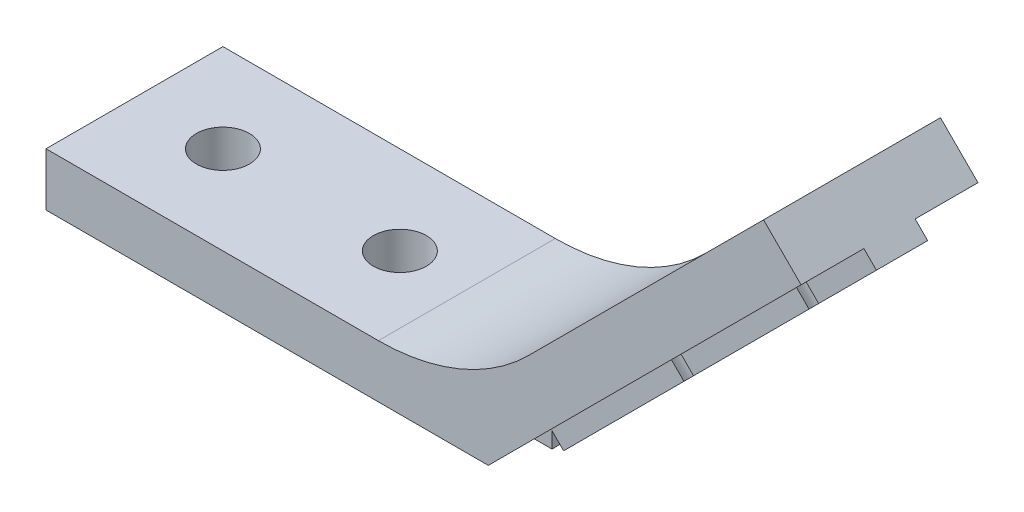
ISO-10303-21;
HEADER;
FILE_DESCRIPTION(('STEP AP214'),'2;1');
FILE_NAME('part.step','',(''),(''),'','','');
FILE_SCHEMA(('AUTOMOTIVE_DESIGN { 1 0 10303 214 1 1 1 1 }'));
ENDSEC;
DATA;
#1=APPLICATION_CONTEXT('core data for automotive mechanical design processes');
#2=APPLICATION_PROTOCOL_DEFINITION('international standard','automotive_design',2000,#1);
#3=PRODUCT_CONTEXT('',#1,'mechanical');
#4=PRODUCT('Part','Part','',(#3));
#5=PRODUCT_RELATED_PRODUCT_CATEGORY('part','',(#4));
#6=PRODUCT_DEFINITION_FORMATION('','',#4);
#7=PRODUCT_DEFINITION_CONTEXT('part definition',#1,'design');
#8=PRODUCT_DEFINITION('design','',#6,#7);
#9=PRODUCT_DEFINITION_SHAPE('','',#8);
#10=(LENGTH_UNIT() NAMED_UNIT(*) SI_UNIT(.MILLI.,.METRE.));
#11=(NAMED_UNIT(*) PLANE_ANGLE_UNIT() SI_UNIT($,.RADIAN.));
#12=(NAMED_UNIT(*) SI_UNIT($,.STERADIAN.) SOLID_ANGLE_UNIT());
#13=UNCERTAINTY_MEASURE_WITH_UNIT(LENGTH_MEASURE(1.E-05),#10,'distance_accuracy_value','');
#14=(GEOMETRIC_REPRESENTATION_CONTEXT(3) GLOBAL_UNCERTAINTY_ASSIGNED_CONTEXT((#13)) GLOBAL_UNIT_ASSIGNED_CONTEXT((#10,
#11,#12)) REPRESENTATION_CONTEXT('',''));
#15=CARTESIAN_POINT('',(0.,0.,0.));
#16=DIRECTION('',(0.,0.,1.));
#17=DIRECTION('',(1.,0.,0.));
#18=AXIS2_PLACEMENT_3D('',#15,#16,#17);
#19=CARTESIAN_POINT('',(18.3847763108502,16.9705627484772,6.45));
#20=DIRECTION('',(0.,0.,-1.));
#21=DIRECTION('',(0.,1.,0.));
#22=AXIS2_PLACEMENT_3D('',#19,#20,#21);
#23=PLANE('',#22);
#24=DIRECTION('',(-0.707106781186547,-0.707106781186548,0.));
#25=VECTOR('',#24,1.);
#26=CARTESIAN_POINT('',(17.6776695296637,17.6776695296637,6.45));
#27=LINE('',#26,#25);
#28=CARTESIAN_POINT('',(17.6776695296637,17.6776695296637,6.45));
#29=VERTEX_POINT('',#28);
#30=CARTESIAN_POINT('',(14.4137051360109,14.413705136011,6.45));
#31=VERTEX_POINT('',#30);
#32=EDGE_CURVE('E248',#29,#31,#27,.T.);
#33=ORIENTED_EDGE('',*,*,#32,.T.);
#34=DIRECTION('',(0.707106781186548,-0.707106781186547,0.));
#35=VECTOR('',#34,1.);
#36=CARTESIAN_POINT('',(-7.98578980060077,36.8132000726226,6.45));
#37=LINE('',#36,#35);
#38=CARTESIAN_POINT('',(15.1208119171975,13.7065983548244,6.45));
#39=VERTEX_POINT('',#38);
#40=EDGE_CURVE('E237',#31,#39,#37,.T.);
#41=ORIENTED_EDGE('',*,*,#40,.T.);
#42=DIRECTION('',(-0.707106781186547,-0.707106781186548,0.));
#43=VECTOR('',#42,1.);
#44=CARTESIAN_POINT('',(18.3847763108502,16.9705627484772,6.45));
#45=LINE('',#44,#43);
#46=CARTESIAN_POINT('',(18.3847763108502,16.9705627484772,6.45));
#47=VERTEX_POINT('',#46);
#48=EDGE_CURVE('E246',#47,#39,#45,.T.);
#49=ORIENTED_EDGE('',*,*,#48,.F.);
#50=DIRECTION('',(-0.707106781186548,0.707106781186547,0.));
#51=VECTOR('',#50,1.);
#52=CARTESIAN_POINT('',(18.3847763108502,16.9705627484772,6.45));
#53=LINE('',#52,#51);
#54=EDGE_CURVE('E293',#47,#29,#53,.T.);
#55=ORIENTED_EDGE('',*,*,#54,.T.);
#56=EDGE_LOOP('',(#33,#41,#49,#55));
#57=FACE_BOUND('',#56,.T.);
#58=ADVANCED_FACE('F34',(#57),#23,.F.);
#59=CARTESIAN_POINT('',(18.3847763108502,16.9705627484772,3.55));
#60=DIRECTION('',(0.,0.,1.));
#61=DIRECTION('',(0.,-1.,0.));
#62=AXIS2_PLACEMENT_3D('',#59,#60,#61);
#63=PLANE('',#62);
#64=DIRECTION('',(0.707106781186547,0.707106781186548,0.));
#65=VECTOR('',#64,1.);
#66=CARTESIAN_POINT('',(17.6776695296637,17.6776695296637,3.55));
#67=LINE('',#66,#65);
#68=CARTESIAN_POINT('',(7.34263732414546,7.34263732414548,3.55));
#69=VERTEX_POINT('',#68);
#70=CARTESIAN_POINT('',(13.8705661114509,13.870566111451,3.55));
#71=VERTEX_POINT('',#70);
#72=EDGE_CURVE('E269',#69,#71,#67,.T.);
#73=ORIENTED_EDGE('',*,*,#72,.T.);
#74=DIRECTION('',(0.707106781186548,-0.707106781186547,0.));
#75=VECTOR('',#74,1.);
#76=CARTESIAN_POINT('',(-8.52892882516078,36.2700610480626,3.55));
#77=LINE('',#76,#75);
#78=CARTESIAN_POINT('',(14.5776728926375,13.1634593302644,3.55));
#79=VERTEX_POINT('',#78);
#80=EDGE_CURVE('E249',#71,#79,#77,.T.);
#81=ORIENTED_EDGE('',*,*,#80,.T.);
#82=DIRECTION('',(0.707106781186547,0.707106781186548,0.));
#83=VECTOR('',#82,1.);
#84=CARTESIAN_POINT('',(18.3847763108502,16.9705627484772,3.55));
#85=LINE('',#84,#83);
#86=CARTESIAN_POINT('',(8.04974410533202,6.63553054295894,3.55));
#87=VERTEX_POINT('',#86);
#88=EDGE_CURVE('E296',#87,#79,#85,.T.);
#89=ORIENTED_EDGE('',*,*,#88,.F.);
#90=DIRECTION('',(0.707106781186548,-0.707106781186547,0.));
#91=VECTOR('',#90,1.);
#92=CARTESIAN_POINT('',(-15.0568576124662,29.7421322607571,3.55));
#93=LINE('',#92,#91);
#94=EDGE_CURVE('E57',#87,#69,#93,.F.);
#95=ORIENTED_EDGE('',*,*,#94,.T.);
#96=EDGE_LOOP('',(#73,#81,#89,#95));
#97=FACE_BOUND('',#96,.T.);
#98=ADVANCED_FACE('F549',(#97),#63,.F.);
#99=CARTESIAN_POINT('',(0.707106781186548,-0.707106781186547,0.));
#100=DIRECTION('',(0.707106781186548,-0.707106781186547,0.));
#101=DIRECTION('',(0.707106781186547,0.707106781186548,0.));
#102=AXIS2_PLACEMENT_3D('',#99,#100,#101);
#103=PLANE('',#102);
#104=CARTESIAN_POINT('',(14.8492424049175,13.4350288425444,5.));
#105=DIRECTION('',(0.707106781186548,-0.707106781186547,0.));
#106=DIRECTION('',(0.707106781186547,0.707106781186548,0.));
#107=AXIS2_PLACEMENT_3D('',#104,#105,#106);
#108=CIRCLE('',#107,1.5);
#109=CARTESIAN_POINT('',(14.5776728926375,13.1634593302644,6.45));
#110=VERTEX_POINT('',#109);
#111=EDGE_CURVE('E11',#110,#79,#108,.T.);
#112=ORIENTED_EDGE('',*,*,#111,.F.);
#113=CARTESIAN_POINT('',(8.04974410533203,6.63553054295895,6.45));
#114=VERTEX_POINT('',#113);
#115=EDGE_CURVE('E257',#110,#114,#45,.T.);
#116=ORIENTED_EDGE('',*,*,#115,.T.);
#117=CARTESIAN_POINT('',(7.77817459305202,6.36396103067894,5.));
#118=DIRECTION('',(0.707106781186548,-0.707106781186547,0.));
#119=DIRECTION('',(0.707106781186547,0.707106781186548,0.));
#120=AXIS2_PLACEMENT_3D('',#117,#118,#119);
#121=CIRCLE('',#120,1.5);
#122=EDGE_CURVE('E459',#87,#114,#121,.T.);
#123=ORIENTED_EDGE('',*,*,#122,.F.);
#124=ORIENTED_EDGE('',*,*,#88,.T.);
#125=EDGE_LOOP('',(#112,#116,#123,#124));
#126=FACE_BOUND('',#125,.T.);
#127=ADVANCED_FACE('F552',(#126),#103,.T.);
#128=ORIENTED_EDGE('',*,*,#115,.F.);
#129=DIRECTION('',(0.707106781186548,-0.707106781186547,0.));
#130=VECTOR('',#129,1.);
#131=CARTESIAN_POINT('',(-8.52892882516078,36.2700610480626,6.45));
#132=LINE('',#131,#130);
#133=CARTESIAN_POINT('',(13.8705661114509,13.870566111451,6.45));
#134=VERTEX_POINT('',#133);
#135=EDGE_CURVE('E489',#110,#134,#132,.F.);
#136=ORIENTED_EDGE('',*,*,#135,.T.);
#137=CARTESIAN_POINT('',(7.34263732414548,7.3426373241455,6.45));
#138=VERTEX_POINT('',#137);
#139=EDGE_CURVE('E288',#134,#138,#27,.T.);
#140=ORIENTED_EDGE('',*,*,#139,.T.);
#141=DIRECTION('',(0.707106781186548,-0.707106781186547,0.));
#142=VECTOR('',#141,1.);
#143=CARTESIAN_POINT('',(-15.0568576124662,29.7421322607571,6.45));
#144=LINE('',#143,#142);
#145=EDGE_CURVE('E488',#138,#114,#144,.T.);
#146=ORIENTED_EDGE('',*,*,#145,.T.);
#147=EDGE_LOOP('',(#128,#136,#140,#146));
#148=FACE_BOUND('',#147,.T.);
#149=ADVANCED_FACE('F487',(#148),#23,.F.);
#150=CARTESIAN_POINT('',(0.,0.,3.54999999999999));
#151=VERTEX_POINT('',#150);
#152=CARTESIAN_POINT('',(6.79949829958547,6.79949829958549,3.55));
#153=VERTEX_POINT('',#152);
#154=EDGE_CURVE('E263',#151,#153,#67,.T.);
#155=ORIENTED_EDGE('',*,*,#154,.T.);
#156=DIRECTION('',(0.707106781186548,-0.707106781186547,0.));
#157=VECTOR('',#156,1.);
#158=CARTESIAN_POINT('',(-15.5999966370262,29.1989932361971,3.55));
#159=LINE('',#158,#157);
#160=CARTESIAN_POINT('',(7.50660508077202,6.09239151839894,3.55));
#161=VERTEX_POINT('',#160);
#162=EDGE_CURVE('E464',#153,#161,#159,.T.);
#163=ORIENTED_EDGE('',*,*,#162,.T.);
#164=CARTESIAN_POINT('',(0.707106781186549,-0.707106781186546,3.54999999999999));
#165=VERTEX_POINT('',#164);
#166=EDGE_CURVE('E294',#165,#161,#85,.T.);
#167=ORIENTED_EDGE('',*,*,#166,.F.);
#168=DIRECTION('',(-0.707106781186548,0.707106781186547,0.));
#169=VECTOR('',#168,1.);
#170=CARTESIAN_POINT('',(0.707106781186549,-0.707106781186546,3.54999999999999));
#171=LINE('',#170,#169);
#172=EDGE_CURVE('E303',#165,#151,#171,.T.);
#173=ORIENTED_EDGE('',*,*,#172,.T.);
#174=EDGE_LOOP('',(#155,#163,#167,#173));
#175=FACE_BOUND('',#174,.T.);
#176=ADVANCED_FACE('F468',(#175),#63,.F.);
#177=CARTESIAN_POINT('',(7.506605080772,6.09239151839893,6.45));
#178=VERTEX_POINT('',#177);
#179=EDGE_CURVE('E242',#178,#161,#121,.T.);
#180=ORIENTED_EDGE('',*,*,#179,.F.);
#181=CARTESIAN_POINT('',(0.707106781186548,-0.707106781186547,6.45));
#182=VERTEX_POINT('',#181);
#183=EDGE_CURVE('E259',#178,#182,#45,.T.);
#184=ORIENTED_EDGE('',*,*,#183,.T.);
#185=DIRECTION('',(0.,0.,-1.));
#186=VECTOR('',#185,1.);
#187=CARTESIAN_POINT('',(0.707106781186548,-0.707106781186547,6.45));
#188=LINE('',#187,#186);
#189=EDGE_CURVE('E256',#182,#165,#188,.T.);
#190=ORIENTED_EDGE('',*,*,#189,.T.);
#191=ORIENTED_EDGE('',*,*,#166,.T.);
#192=EDGE_LOOP('',(#180,#184,#190,#191));
#193=FACE_BOUND('',#192,.T.);
#194=ADVANCED_FACE('F557',(#193),#103,.T.);
#195=CARTESIAN_POINT('',(0.,0.,10.));
#196=DIRECTION('',(-0.707106781186548,0.707106781186547,0.));
#197=DIRECTION('',(-0.707106781186547,-0.707106781186548,0.));
#198=AXIS2_PLACEMENT_3D('',#195,#196,#197);
#199=PLANE('',#198);
#200=ORIENTED_EDGE('',*,*,#139,.F.);
#201=CARTESIAN_POINT('',(14.1421356237309,14.142135623731,5.));
#202=DIRECTION('',(-0.707106781186548,0.707106781186547,0.));
#203=DIRECTION('',(-0.707106781186547,-0.707106781186548,0.));
#204=AXIS2_PLACEMENT_3D('',#201,#202,#203);
#205=CIRCLE('',#204,1.5);
#206=EDGE_CURVE('E536',#134,#31,#205,.T.);
#207=ORIENTED_EDGE('',*,*,#206,.T.);
#208=ORIENTED_EDGE('',*,*,#32,.F.);
#209=DIRECTION('',(0.,0.,-1.));
#210=VECTOR('',#209,1.);
#211=CARTESIAN_POINT('',(17.6776695296637,17.6776695296637,10.));
#212=LINE('',#211,#210);
#213=CARTESIAN_POINT('',(17.6776695296637,17.6776695296637,10.));
#214=VERTEX_POINT('',#213);
#215=EDGE_CURVE('E309',#214,#29,#212,.T.);
#216=ORIENTED_EDGE('',*,*,#215,.F.);
#217=DIRECTION('',(0.707106781186547,0.707106781186548,0.));
#218=VECTOR('',#217,1.);
#219=CARTESIAN_POINT('',(0.,0.,10.));
#220=LINE('',#219,#218);
#221=CARTESIAN_POINT('',(0.,0.,10.));
#222=VERTEX_POINT('',#221);
#223=EDGE_CURVE('E403',#222,#214,#220,.T.);
#224=ORIENTED_EDGE('',*,*,#223,.F.);
#225=DIRECTION('',(0.,0.,-1.));
#226=VECTOR('',#225,1.);
#227=CARTESIAN_POINT('',(0.,0.,10.));
#228=LINE('',#227,#226);
#229=CARTESIAN_POINT('',(0.,0.,6.45));
#230=VERTEX_POINT('',#229);
#231=EDGE_CURVE('E443',#222,#230,#228,.T.);
#232=ORIENTED_EDGE('',*,*,#231,.T.);
#233=CARTESIAN_POINT('',(6.79949829958546,6.79949829958547,6.45));
#234=VERTEX_POINT('',#233);
#235=EDGE_CURVE('E290',#234,#230,#27,.T.);
#236=ORIENTED_EDGE('',*,*,#235,.F.);
#237=CARTESIAN_POINT('',(7.07106781186547,7.07106781186549,5.));
#238=DIRECTION('',(-0.707106781186548,0.707106781186547,0.));
#239=DIRECTION('',(-0.707106781186547,-0.707106781186548,0.));
#240=AXIS2_PLACEMENT_3D('',#237,#238,#239);
#241=CIRCLE('',#240,1.5);
#242=EDGE_CURVE('E469',#234,#138,#241,.T.);
#243=ORIENTED_EDGE('',*,*,#242,.T.);
#244=EDGE_LOOP('',(#200,#207,#208,#216,#224,#232,#236,#243));
#245=FACE_BOUND('',#244,.T.);
#246=ADVANCED_FACE('F492',(#245),#199,.F.);
#247=CARTESIAN_POINT('',(14.4137051360109,14.413705136011,3.55));
#248=VERTEX_POINT('',#247);
#249=CARTESIAN_POINT('',(17.6776695296637,17.6776695296637,3.55));
#250=VERTEX_POINT('',#249);
#251=EDGE_CURVE('E271',#248,#250,#67,.T.);
#252=ORIENTED_EDGE('',*,*,#251,.F.);
#253=CARTESIAN_POINT('',(14.1421356237309,14.142135623731,5.));
#254=DIRECTION('',(-0.707106781186548,0.707106781186547,0.));
#255=DIRECTION('',(-0.707106781186547,-0.707106781186548,0.));
#256=AXIS2_PLACEMENT_3D('',#253,#254,#255);
#257=CIRCLE('',#256,1.5);
#258=EDGE_CURVE('E250',#248,#71,#257,.T.);
#259=ORIENTED_EDGE('',*,*,#258,.T.);
#260=ORIENTED_EDGE('',*,*,#72,.F.);
#261=CARTESIAN_POINT('',(7.07106781186547,7.07106781186549,5.));
#262=DIRECTION('',(-0.707106781186548,0.707106781186547,0.));
#263=DIRECTION('',(-0.707106781186547,-0.707106781186548,0.));
#264=AXIS2_PLACEMENT_3D('',#261,#262,#263);
#265=CIRCLE('',#264,1.5);
#266=EDGE_CURVE('E474',#69,#153,#265,.T.);
#267=ORIENTED_EDGE('',*,*,#266,.T.);
#268=ORIENTED_EDGE('',*,*,#154,.F.);
#269=CARTESIAN_POINT('',(0.,0.,0.));
#270=VERTEX_POINT('',#269);
#271=EDGE_CURVE('E442',#151,#270,#228,.T.);
#272=ORIENTED_EDGE('',*,*,#271,.T.);
#273=DIRECTION('',(0.707106781186547,0.707106781186548,0.));
#274=VECTOR('',#273,1.);
#275=CARTESIAN_POINT('',(0.,0.,0.));
#276=LINE('',#275,#274);
#277=CARTESIAN_POINT('',(17.6776695296637,17.6776695296637,0.));
#278=VERTEX_POINT('',#277);
#279=EDGE_CURVE('E419',#270,#278,#276,.T.);
#280=ORIENTED_EDGE('',*,*,#279,.T.);
#281=EDGE_CURVE('E440',#250,#278,#212,.T.);
#282=ORIENTED_EDGE('',*,*,#281,.F.);
#283=EDGE_LOOP('',(#252,#259,#260,#267,#268,#272,#280,#282));
#284=FACE_BOUND('',#283,.T.);
#285=ADVANCED_FACE('F517',(#284),#199,.F.);
#286=CARTESIAN_POINT('',(0.,-1.,6.4));
#287=DIRECTION('',(0.,0.,-1.));
#288=DIRECTION('',(-1.,0.,0.));
#289=AXIS2_PLACEMENT_3D('',#286,#287,#288);
#290=PLANE('',#289);
#291=DIRECTION('',(-1.,0.,0.));
#292=VECTOR('',#291,1.);
#293=CARTESIAN_POINT('',(0.,0.,6.4));
#294=LINE('',#293,#292);
#295=CARTESIAN_POINT('',(0.,0.,6.4));
#296=VERTEX_POINT('',#295);
#297=CARTESIAN_POINT('',(-9.46148351928657,0.,6.4));
#298=VERTEX_POINT('',#297);
#299=EDGE_CURVE('E377',#296,#298,#294,.T.);
#300=ORIENTED_EDGE('',*,*,#299,.T.);
#301=DIRECTION('',(0.,-1.,0.));
#302=VECTOR('',#301,1.);
#303=CARTESIAN_POINT('',(-9.46148351928657,19.7989898732234,6.4));
#304=LINE('',#303,#302);
#305=CARTESIAN_POINT('',(-9.46148351928657,-1.,6.4));
#306=VERTEX_POINT('',#305);
#307=EDGE_CURVE('E329',#298,#306,#304,.T.);
#308=ORIENTED_EDGE('',*,*,#307,.T.);
#309=DIRECTION('',(-1.,0.,0.));
#310=VECTOR('',#309,1.);
#311=CARTESIAN_POINT('',(0.,-1.,6.4));
#312=LINE('',#311,#310);
#313=CARTESIAN_POINT('',(0.,-1.,6.4));
#314=VERTEX_POINT('',#313);
#315=EDGE_CURVE('E362',#314,#306,#312,.T.);
#316=ORIENTED_EDGE('',*,*,#315,.F.);
#317=DIRECTION('',(0.,1.,0.));
#318=VECTOR('',#317,1.);
#319=CARTESIAN_POINT('',(0.,-1.,6.4));
#320=LINE('',#319,#318);
#321=EDGE_CURVE('E393',#314,#296,#320,.T.);
#322=ORIENTED_EDGE('',*,*,#321,.T.);
#323=EDGE_LOOP('',(#300,#308,#316,#322));
#324=FACE_BOUND('',#323,.T.);
#325=ADVANCED_FACE('F500',(#324),#290,.F.);
#326=CARTESIAN_POINT('',(0.,-1.,0.));
#327=DIRECTION('',(0.,1.,0.));
#328=DIRECTION('',(0.,0.,1.));
#329=AXIS2_PLACEMENT_3D('',#326,#327,#328);
#330=PLANE('',#329);
#331=ORIENTED_EDGE('',*,*,#315,.T.);
#332=CARTESIAN_POINT('',(-10.,-1.,5.));
#333=DIRECTION('',(0.,-1.,0.));
#334=DIRECTION('',(0.,0.,-1.));
#335=AXIS2_PLACEMENT_3D('',#332,#333,#334);
#336=CIRCLE('',#335,1.5);
#337=CARTESIAN_POINT('',(-9.46148351928655,-1.,3.6));
#338=VERTEX_POINT('',#337);
#339=EDGE_CURVE('E315',#338,#306,#336,.T.);
#340=ORIENTED_EDGE('',*,*,#339,.F.);
#341=DIRECTION('',(1.,0.,0.));
#342=VECTOR('',#341,1.);
#343=CARTESIAN_POINT('',(0.,-1.,3.6));
#344=LINE('',#343,#342);
#345=CARTESIAN_POINT('',(0.,-1.,3.6));
#346=VERTEX_POINT('',#345);
#347=EDGE_CURVE('E368',#338,#346,#344,.T.);
#348=ORIENTED_EDGE('',*,*,#347,.T.);
#349=DIRECTION('',(0.,0.,1.));
#350=VECTOR('',#349,1.);
#351=CARTESIAN_POINT('',(0.,-1.,6.4));
#352=LINE('',#351,#350);
#353=EDGE_CURVE('E357',#346,#314,#352,.T.);
#354=ORIENTED_EDGE('',*,*,#353,.T.);
#355=EDGE_LOOP('',(#331,#340,#348,#354));
#356=FACE_BOUND('',#355,.T.);
#357=ADVANCED_FACE('F593',(#356),#330,.F.);
#358=CARTESIAN_POINT('',(0.,-1.,3.6));
#359=DIRECTION('',(0.,0.,1.));
#360=DIRECTION('',(1.,0.,0.));
#361=AXIS2_PLACEMENT_3D('',#358,#359,#360);
#362=PLANE('',#361);
#363=DIRECTION('',(1.,0.,0.));
#364=VECTOR('',#363,1.);
#365=CARTESIAN_POINT('',(0.,0.,3.6));
#366=LINE('',#365,#364);
#367=CARTESIAN_POINT('',(-19.4614835192866,0.,3.59999999999999));
#368=VERTEX_POINT('',#367);
#369=CARTESIAN_POINT('',(-10.5385164807134,0.,3.6));
#370=VERTEX_POINT('',#369);
#371=EDGE_CURVE('E384',#368,#370,#366,.T.);
#372=ORIENTED_EDGE('',*,*,#371,.T.);
#373=DIRECTION('',(0.,-1.,0.));
#374=VECTOR('',#373,1.);
#375=CARTESIAN_POINT('',(-10.5385164807134,19.7989898732234,3.6));
#376=LINE('',#375,#374);
#377=CARTESIAN_POINT('',(-10.5385164807134,-1.,3.6));
#378=VERTEX_POINT('',#377);
#379=EDGE_CURVE('E457',#370,#378,#376,.T.);
#380=ORIENTED_EDGE('',*,*,#379,.T.);
#381=CARTESIAN_POINT('',(-19.4614835192866,-1.,3.59999999999999));
#382=VERTEX_POINT('',#381);
#383=EDGE_CURVE('E373',#382,#378,#344,.T.);
#384=ORIENTED_EDGE('',*,*,#383,.F.);
#385=DIRECTION('',(0.,-1.,0.));
#386=VECTOR('',#385,1.);
#387=CARTESIAN_POINT('',(-19.4614835192866,19.7989898732234,3.59999999999999));
#388=LINE('',#387,#386);
#389=EDGE_CURVE('E335',#382,#368,#388,.F.);
#390=ORIENTED_EDGE('',*,*,#389,.T.);
#391=EDGE_LOOP('',(#372,#380,#384,#390));
#392=FACE_BOUND('',#391,.T.);
#393=ADVANCED_FACE('F598',(#392),#362,.F.);
#394=CARTESIAN_POINT('',(-10.5385164807134,-1.,6.4));
#395=VERTEX_POINT('',#394);
#396=CARTESIAN_POINT('',(-19.4614835192866,-1.,6.4));
#397=VERTEX_POINT('',#396);
#398=EDGE_CURVE('E366',#395,#397,#312,.T.);
#399=ORIENTED_EDGE('',*,*,#398,.F.);
#400=DIRECTION('',(0.,-1.,0.));
#401=VECTOR('',#400,1.);
#402=CARTESIAN_POINT('',(-10.5385164807134,19.7989898732234,6.4));
#403=LINE('',#402,#401);
#404=CARTESIAN_POINT('',(-10.5385164807134,0.,6.4));
#405=VERTEX_POINT('',#404);
#406=EDGE_CURVE('E326',#395,#405,#403,.F.);
#407=ORIENTED_EDGE('',*,*,#406,.T.);
#408=CARTESIAN_POINT('',(-19.4614835192866,0.,6.4));
#409=VERTEX_POINT('',#408);
#410=EDGE_CURVE('E381',#405,#409,#294,.T.);
#411=ORIENTED_EDGE('',*,*,#410,.T.);
#412=DIRECTION('',(0.,-1.,0.));
#413=VECTOR('',#412,1.);
#414=CARTESIAN_POINT('',(-19.4614835192866,19.7989898732234,6.4));
#415=LINE('',#414,#413);
#416=EDGE_CURVE('E350',#409,#397,#415,.T.);
#417=ORIENTED_EDGE('',*,*,#416,.T.);
#418=EDGE_LOOP('',(#399,#407,#411,#417));
#419=FACE_BOUND('',#418,.T.);
#420=ADVANCED_FACE('F603',(#419),#290,.F.);
#421=CARTESIAN_POINT('',(-25.,0.,3.6));
#422=VERTEX_POINT('',#421);
#423=CARTESIAN_POINT('',(-20.5385164807134,0.,3.59999999999999));
#424=VERTEX_POINT('',#423);
#425=EDGE_CURVE('E361',#422,#424,#366,.T.);
#426=ORIENTED_EDGE('',*,*,#425,.T.);
#427=DIRECTION('',(0.,-1.,0.));
#428=VECTOR('',#427,1.);
#429=CARTESIAN_POINT('',(-20.5385164807134,19.7989898732234,3.59999999999999));
#430=LINE('',#429,#428);
#431=CARTESIAN_POINT('',(-20.5385164807134,-1.,3.59999999999999));
#432=VERTEX_POINT('',#431);
#433=EDGE_CURVE('E341',#424,#432,#430,.T.);
#434=ORIENTED_EDGE('',*,*,#433,.T.);
#435=CARTESIAN_POINT('',(-25.,-1.,3.59999999999999));
#436=VERTEX_POINT('',#435);
#437=EDGE_CURVE('E369',#436,#432,#344,.T.);
#438=ORIENTED_EDGE('',*,*,#437,.F.);
#439=DIRECTION('',(0.,1.,0.));
#440=VECTOR('',#439,1.);
#441=CARTESIAN_POINT('',(-25.,-1.,3.59999999999999));
#442=LINE('',#441,#440);
#443=EDGE_CURVE('E387',#436,#422,#442,.T.);
#444=ORIENTED_EDGE('',*,*,#443,.T.);
#445=EDGE_LOOP('',(#426,#434,#438,#444));
#446=FACE_BOUND('',#445,.T.);
#447=ADVANCED_FACE('F599',(#446),#362,.F.);
#448=ORIENTED_EDGE('',*,*,#383,.T.);
#449=EDGE_CURVE('E314',#395,#378,#336,.T.);
#450=ORIENTED_EDGE('',*,*,#449,.F.);
#451=ORIENTED_EDGE('',*,*,#398,.T.);
#452=CARTESIAN_POINT('',(-20.,-1.,5.));
#453=DIRECTION('',(0.,-1.,0.));
#454=DIRECTION('',(0.,0.,-1.));
#455=AXIS2_PLACEMENT_3D('',#452,#453,#454);
#456=CIRCLE('',#455,1.5);
#457=EDGE_CURVE('E332',#382,#397,#456,.T.);
#458=ORIENTED_EDGE('',*,*,#457,.F.);
#459=EDGE_LOOP('',(#448,#450,#451,#458));
#460=FACE_BOUND('',#459,.T.);
#461=ADVANCED_FACE('F594',(#460),#330,.F.);
#462=CARTESIAN_POINT('',(-25.,0.,10.));
#463=DIRECTION('',(0.,1.,0.));
#464=DIRECTION('',(0.,0.,1.));
#465=AXIS2_PLACEMENT_3D('',#462,#463,#464);
#466=PLANE('',#465);
#467=CARTESIAN_POINT('',(-9.46148351928655,0.,3.6));
#468=VERTEX_POINT('',#467);
#469=CARTESIAN_POINT('',(0.,0.,3.6));
#470=VERTEX_POINT('',#469);
#471=EDGE_CURVE('E380',#468,#470,#366,.T.);
#472=ORIENTED_EDGE('',*,*,#471,.F.);
#473=CARTESIAN_POINT('',(-10.,0.,5.));
#474=DIRECTION('',(0.,1.,0.));
#475=DIRECTION('',(0.,0.,1.));
#476=AXIS2_PLACEMENT_3D('',#473,#474,#475);
#477=CIRCLE('',#476,1.5);
#478=EDGE_CURVE('E317',#468,#370,#477,.T.);
#479=ORIENTED_EDGE('',*,*,#478,.T.);
#480=ORIENTED_EDGE('',*,*,#371,.F.);
#481=CARTESIAN_POINT('',(-20.,0.,5.));
#482=DIRECTION('',(0.,1.,0.));
#483=DIRECTION('',(0.,0.,1.));
#484=AXIS2_PLACEMENT_3D('',#481,#482,#483);
#485=CIRCLE('',#484,1.5);
#486=EDGE_CURVE('E338',#368,#424,#485,.T.);
#487=ORIENTED_EDGE('',*,*,#486,.T.);
#488=ORIENTED_EDGE('',*,*,#425,.F.);
#489=DIRECTION('',(0.,0.,-1.));
#490=VECTOR('',#489,1.);
#491=CARTESIAN_POINT('',(-25.,0.,10.));
#492=LINE('',#491,#490);
#493=CARTESIAN_POINT('',(-25.,0.,0.));
#494=VERTEX_POINT('',#493);
#495=EDGE_CURVE('E446',#422,#494,#492,.T.);
#496=ORIENTED_EDGE('',*,*,#495,.T.);
#497=DIRECTION('',(1.,0.,0.));
#498=VECTOR('',#497,1.);
#499=CARTESIAN_POINT('',(-25.,0.,0.));
#500=LINE('',#499,#498);
#501=EDGE_CURVE('E416',#494,#270,#500,.T.);
#502=ORIENTED_EDGE('',*,*,#501,.T.);
#503=ORIENTED_EDGE('',*,*,#271,.F.);
#504=EDGE_CURVE('E447',#470,#151,#228,.T.);
#505=ORIENTED_EDGE('',*,*,#504,.F.);
#506=EDGE_LOOP('',(#472,#479,#480,#487,#488,#496,#502,#503,#505));
#507=FACE_BOUND('',#506,.T.);
#508=ADVANCED_FACE('F515',(#507),#466,.F.);
#509=ORIENTED_EDGE('',*,*,#410,.F.);
#510=CARTESIAN_POINT('',(-10.,0.,5.));
#511=DIRECTION('',(0.,1.,0.));
#512=DIRECTION('',(0.,0.,1.));
#513=AXIS2_PLACEMENT_3D('',#510,#511,#512);
#514=CIRCLE('',#513,1.5);
#515=EDGE_CURVE('E323',#405,#298,#514,.T.);
#516=ORIENTED_EDGE('',*,*,#515,.T.);
#517=ORIENTED_EDGE('',*,*,#299,.F.);
#518=DIRECTION('',(0.,0.,-1.));
#519=VECTOR('',#518,1.);
#520=CARTESIAN_POINT('',(0.,0.,6.45));
#521=LINE('',#520,#519);
#522=EDGE_CURVE('E279',#230,#296,#521,.T.);
#523=ORIENTED_EDGE('',*,*,#522,.F.);
#524=ORIENTED_EDGE('',*,*,#231,.F.);
#525=DIRECTION('',(1.,0.,0.));
#526=VECTOR('',#525,1.);
#527=CARTESIAN_POINT('',(-25.,0.,10.));
#528=LINE('',#527,#526);
#529=CARTESIAN_POINT('',(-25.,0.,10.));
#530=VERTEX_POINT('',#529);
#531=EDGE_CURVE('E400',#530,#222,#528,.T.);
#532=ORIENTED_EDGE('',*,*,#531,.F.);
#533=CARTESIAN_POINT('',(-25.,0.,6.4));
#534=VERTEX_POINT('',#533);
#535=EDGE_CURVE('E448',#530,#534,#492,.T.);
#536=ORIENTED_EDGE('',*,*,#535,.T.);
#537=CARTESIAN_POINT('',(-20.5385164807134,0.,6.4));
#538=VERTEX_POINT('',#537);
#539=EDGE_CURVE('E376',#538,#534,#294,.T.);
#540=ORIENTED_EDGE('',*,*,#539,.F.);
#541=CARTESIAN_POINT('',(-20.,0.,5.));
#542=DIRECTION('',(0.,1.,0.));
#543=DIRECTION('',(0.,0.,1.));
#544=AXIS2_PLACEMENT_3D('',#541,#542,#543);
#545=CIRCLE('',#544,1.5);
#546=EDGE_CURVE('E347',#538,#409,#545,.T.);
#547=ORIENTED_EDGE('',*,*,#546,.T.);
#548=EDGE_LOOP('',(#509,#516,#517,#523,#524,#532,#536,#540,#547));
#549=FACE_BOUND('',#548,.T.);
#550=ADVANCED_FACE('F497',(#549),#466,.F.);
#551=CARTESIAN_POINT('',(-25.,3.,10.));
#552=DIRECTION('',(1.,0.,0.));
#553=DIRECTION('',(0.,0.,-1.));
#554=AXIS2_PLACEMENT_3D('',#551,#552,#553);
#555=PLANE('',#554);
#556=DIRECTION('',(0.,-1.,0.));
#557=VECTOR('',#556,1.);
#558=CARTESIAN_POINT('',(-25.,3.,0.));
#559=LINE('',#558,#557);
#560=CARTESIAN_POINT('',(-25.,3.,0.));
#561=VERTEX_POINT('',#560);
#562=EDGE_CURVE('E396',#561,#494,#559,.T.);
#563=ORIENTED_EDGE('',*,*,#562,.T.);
#564=ORIENTED_EDGE('',*,*,#495,.F.);
#565=ORIENTED_EDGE('',*,*,#443,.F.);
#566=DIRECTION('',(0.,0.,-1.));
#567=VECTOR('',#566,1.);
#568=CARTESIAN_POINT('',(-25.,-1.,6.4));
#569=LINE('',#568,#567);
#570=CARTESIAN_POINT('',(-25.,-1.,6.4));
#571=VERTEX_POINT('',#570);
#572=EDGE_CURVE('E365',#571,#436,#569,.T.);
#573=ORIENTED_EDGE('',*,*,#572,.F.);
#574=DIRECTION('',(0.,1.,0.));
#575=VECTOR('',#574,1.);
#576=CARTESIAN_POINT('',(-25.,-1.,6.4));
#577=LINE('',#576,#575);
#578=EDGE_CURVE('E390',#571,#534,#577,.T.);
#579=ORIENTED_EDGE('',*,*,#578,.T.);
#580=ORIENTED_EDGE('',*,*,#535,.F.);
#581=DIRECTION('',(0.,-1.,0.));
#582=VECTOR('',#581,1.);
#583=CARTESIAN_POINT('',(-25.,3.,10.));
#584=LINE('',#583,#582);
#585=CARTESIAN_POINT('',(-25.,3.,10.));
#586=VERTEX_POINT('',#585);
#587=EDGE_CURVE('E397',#586,#530,#584,.T.);
#588=ORIENTED_EDGE('',*,*,#587,.F.);
#589=DIRECTION('',(0.,0.,-1.));
#590=VECTOR('',#589,1.);
#591=CARTESIAN_POINT('',(-25.,3.,10.));
#592=LINE('',#591,#590);
#593=EDGE_CURVE('E413',#586,#561,#592,.T.);
#594=ORIENTED_EDGE('',*,*,#593,.T.);
#595=EDGE_LOOP('',(#563,#564,#565,#573,#579,#580,#588,#594));
#596=FACE_BOUND('',#595,.T.);
#597=ADVANCED_FACE('F36',(#596),#555,.F.);
#598=CARTESIAN_POINT('',(17.6776695296637,17.6776695296637,10.));
#599=DIRECTION('',(-0.707106781186546,-0.707106781186549,0.));
#600=DIRECTION('',(0.707106781186549,-0.707106781186546,0.));
#601=AXIS2_PLACEMENT_3D('',#598,#599,#600);
#602=PLANE('',#601);
#603=DIRECTION('',(-0.707106781186549,0.707106781186546,0.));
#604=VECTOR('',#603,1.);
#605=CARTESIAN_POINT('',(17.6776695296637,17.6776695296637,0.));
#606=LINE('',#605,#604);
#607=CARTESIAN_POINT('',(15.556349186104,19.7989898732234,0.));
#608=VERTEX_POINT('',#607);
#609=EDGE_CURVE('E422',#278,#608,#606,.T.);
#610=ORIENTED_EDGE('',*,*,#609,.T.);
#611=DIRECTION('',(0.,0.,-1.));
#612=VECTOR('',#611,1.);
#613=CARTESIAN_POINT('',(15.556349186104,19.7989898732234,10.));
#614=LINE('',#613,#612);
#615=CARTESIAN_POINT('',(15.556349186104,19.7989898732234,10.));
#616=VERTEX_POINT('',#615);
#617=EDGE_CURVE('E437',#616,#608,#614,.T.);
#618=ORIENTED_EDGE('',*,*,#617,.F.);
#619=DIRECTION('',(-0.707106781186549,0.707106781186546,0.));
#620=VECTOR('',#619,1.);
#621=CARTESIAN_POINT('',(17.6776695296637,17.6776695296637,10.));
#622=LINE('',#621,#620);
#623=EDGE_CURVE('E405',#214,#616,#622,.T.);
#624=ORIENTED_EDGE('',*,*,#623,.F.);
#625=ORIENTED_EDGE('',*,*,#215,.T.);
#626=ORIENTED_EDGE('',*,*,#54,.F.);
#627=DIRECTION('',(0.,0.,1.));
#628=VECTOR('',#627,1.);
#629=CARTESIAN_POINT('',(18.3847763108502,16.9705627484772,6.45));
#630=LINE('',#629,#628);
#631=CARTESIAN_POINT('',(18.3847763108502,16.9705627484772,3.55));
#632=VERTEX_POINT('',#631);
#633=EDGE_CURVE('E254',#632,#47,#630,.T.);
#634=ORIENTED_EDGE('',*,*,#633,.F.);
#635=DIRECTION('',(-0.707106781186548,0.707106781186547,0.));
#636=VECTOR('',#635,1.);
#637=CARTESIAN_POINT('',(18.3847763108502,16.9705627484772,3.55));
#638=LINE('',#637,#636);
#639=EDGE_CURVE('E299',#632,#250,#638,.T.);
#640=ORIENTED_EDGE('',*,*,#639,.T.);
#641=ORIENTED_EDGE('',*,*,#281,.T.);
#642=EDGE_LOOP('',(#610,#618,#624,#625,#626,#634,#640,#641));
#643=FACE_BOUND('',#642,.T.);
#644=ADVANCED_FACE('F305',(#643),#602,.F.);
#645=CARTESIAN_POINT('',(15.556349186104,19.7989898732234,10.));
#646=DIRECTION('',(0.707106781186548,-0.707106781186547,0.));
#647=DIRECTION('',(0.707106781186547,0.707106781186548,0.));
#648=AXIS2_PLACEMENT_3D('',#645,#646,#647);
#649=PLANE('',#648);
#650=CARTESIAN_POINT('',(12.0208152801713,16.2634559672906,5.));
#651=DIRECTION('',(0.707106781186548,-0.707106781186547,0.));
#652=DIRECTION('',(0.707106781186547,0.707106781186548,0.));
#653=AXIS2_PLACEMENT_3D('',#650,#651,#652);
#654=CIRCLE('',#653,1.5);
#655=CARTESIAN_POINT('',(13.0814754519511,17.3241161390704,5.));
#656=VERTEX_POINT('',#655);
#657=EDGE_CURVE('E538',#656,#656,#654,.T.);
#658=ORIENTED_EDGE('',*,*,#657,.T.);
#659=EDGE_LOOP('',(#658));
#660=FACE_BOUND('',#659,.T.);
#661=CARTESIAN_POINT('',(4.94974746830582,9.19238815542513,5.));
#662=DIRECTION('',(0.707106781186548,-0.707106781186547,0.));
#663=DIRECTION('',(0.707106781186547,0.707106781186548,0.));
#664=AXIS2_PLACEMENT_3D('',#661,#662,#663);
#665=CIRCLE('',#664,1.5);
#666=CARTESIAN_POINT('',(6.01040764008564,10.2530483272049,5.));
#667=VERTEX_POINT('',#666);
#668=EDGE_CURVE('E471',#667,#667,#665,.T.);
#669=ORIENTED_EDGE('',*,*,#668,.T.);
#670=EDGE_LOOP('',(#669));
#671=FACE_BOUND('',#670,.T.);
#672=DIRECTION('',(-0.707106781186547,-0.707106781186548,0.));
#673=VECTOR('',#672,1.);
#674=CARTESIAN_POINT('',(15.556349186104,19.7989898732234,0.));
#675=LINE('',#674,#673);
#676=CARTESIAN_POINT('',(2.27207793864212,6.51471862576143,0.));
#677=VERTEX_POINT('',#676);
#678=EDGE_CURVE('E424',#608,#677,#675,.T.);
#679=ORIENTED_EDGE('',*,*,#678,.T.);
#680=DIRECTION('',(0.,0.,-1.));
#681=VECTOR('',#680,1.);
#682=CARTESIAN_POINT('',(2.27207793864212,6.51471862576143,10.));
#683=LINE('',#682,#681);
#684=CARTESIAN_POINT('',(2.27207793864212,6.51471862576143,10.));
#685=VERTEX_POINT('',#684);
#686=EDGE_CURVE('E434',#685,#677,#683,.T.);
#687=ORIENTED_EDGE('',*,*,#686,.F.);
#688=DIRECTION('',(-0.707106781186547,-0.707106781186548,0.));
#689=VECTOR('',#688,1.);
#690=CARTESIAN_POINT('',(15.556349186104,19.7989898732234,10.));
#691=LINE('',#690,#689);
#692=EDGE_CURVE('E407',#616,#685,#691,.T.);
#693=ORIENTED_EDGE('',*,*,#692,.F.);
#694=ORIENTED_EDGE('',*,*,#617,.T.);
#695=EDGE_LOOP('',(#679,#687,#693,#694));
#696=FACE_BOUND('',#695,.T.);
#697=ADVANCED_FACE('F530',(#660,#671,#696),#649,.F.);
#698=CARTESIAN_POINT('',(-6.21320343559645,15.,10.));
#699=DIRECTION('',(0.,0.,-1.));
#700=DIRECTION('',(-1.,0.,0.));
#701=AXIS2_PLACEMENT_3D('',#698,#699,#700);
#702=CYLINDRICAL_SURFACE('',#701,12.);
#703=CARTESIAN_POINT('',(-6.21320343559645,15.,0.));
#704=DIRECTION('',(0.,0.,-1.));
#705=DIRECTION('',(-1.,0.,0.));
#706=AXIS2_PLACEMENT_3D('',#703,#704,#705);
#707=CIRCLE('',#706,12.);
#708=CARTESIAN_POINT('',(-6.21320343559643,3.,0.));
#709=VERTEX_POINT('',#708);
#710=EDGE_CURVE('E426',#677,#709,#707,.T.);
#711=ORIENTED_EDGE('',*,*,#710,.T.);
#712=DIRECTION('',(0.,0.,-1.));
#713=VECTOR('',#712,1.);
#714=CARTESIAN_POINT('',(-6.21320343559643,3.,10.));
#715=LINE('',#714,#713);
#716=CARTESIAN_POINT('',(-6.21320343559643,3.,10.));
#717=VERTEX_POINT('',#716);
#718=EDGE_CURVE('E431',#717,#709,#715,.T.);
#719=ORIENTED_EDGE('',*,*,#718,.F.);
#720=CARTESIAN_POINT('',(-6.21320343559645,15.,10.));
#721=DIRECTION('',(0.,0.,-1.));
#722=DIRECTION('',(-1.,0.,0.));
#723=AXIS2_PLACEMENT_3D('',#720,#721,#722);
#724=CIRCLE('',#723,12.);
#725=EDGE_CURVE('E409',#685,#717,#724,.T.);
#726=ORIENTED_EDGE('',*,*,#725,.F.);
#727=ORIENTED_EDGE('',*,*,#686,.T.);
#728=EDGE_LOOP('',(#711,#719,#726,#727));
#729=FACE_BOUND('',#728,.T.);
#730=ADVANCED_FACE('F613',(#729),#702,.F.);
#731=CARTESIAN_POINT('',(-6.21320343559644,3.,10.));
#732=DIRECTION('',(0.,-1.,0.));
#733=DIRECTION('',(0.,0.,-1.));
#734=AXIS2_PLACEMENT_3D('',#731,#732,#733);
#735=PLANE('',#734);
#736=CARTESIAN_POINT('',(-10.,3.,5.));
#737=DIRECTION('',(0.,-1.,0.));
#738=DIRECTION('',(0.,0.,-1.));
#739=AXIS2_PLACEMENT_3D('',#736,#737,#738);
#740=CIRCLE('',#739,1.5);
#741=CARTESIAN_POINT('',(-10.,3.,3.5));
#742=VERTEX_POINT('',#741);
#743=EDGE_CURVE('E320',#742,#742,#740,.T.);
#744=ORIENTED_EDGE('',*,*,#743,.T.);
#745=EDGE_LOOP('',(#744));
#746=FACE_BOUND('',#745,.T.);
#747=CARTESIAN_POINT('',(-20.,3.,5.));
#748=DIRECTION('',(0.,-1.,0.));
#749=DIRECTION('',(0.,0.,-1.));
#750=AXIS2_PLACEMENT_3D('',#747,#748,#749);
#751=CIRCLE('',#750,1.5);
#752=CARTESIAN_POINT('',(-20.,3.,3.5));
#753=VERTEX_POINT('',#752);
#754=EDGE_CURVE('E353',#753,#753,#751,.T.);
#755=ORIENTED_EDGE('',*,*,#754,.T.);
#756=EDGE_LOOP('',(#755));
#757=FACE_BOUND('',#756,.T.);
#758=DIRECTION('',(-1.,0.,0.));
#759=VECTOR('',#758,1.);
#760=CARTESIAN_POINT('',(-6.21320343559644,3.,0.));
#761=LINE('',#760,#759);
#762=EDGE_CURVE('E401',#709,#561,#761,.T.);
#763=ORIENTED_EDGE('',*,*,#762,.T.);
#764=ORIENTED_EDGE('',*,*,#593,.F.);
#765=DIRECTION('',(-1.,0.,0.));
#766=VECTOR('',#765,1.);
#767=CARTESIAN_POINT('',(-6.21320343559644,3.,10.));
#768=LINE('',#767,#766);
#769=EDGE_CURVE('E411',#717,#586,#768,.T.);
#770=ORIENTED_EDGE('',*,*,#769,.F.);
#771=ORIENTED_EDGE('',*,*,#718,.T.);
#772=EDGE_LOOP('',(#763,#764,#770,#771));
#773=FACE_BOUND('',#772,.T.);
#774=ADVANCED_FACE('F608',(#746,#757,#773),#735,.F.);
#775=CARTESIAN_POINT('',(-6.21320343559645,15.,10.));
#776=DIRECTION('',(0.,0.,-1.));
#777=DIRECTION('',(-1.,0.,0.));
#778=AXIS2_PLACEMENT_3D('',#775,#776,#777);
#779=PLANE('',#778);
#780=ORIENTED_EDGE('',*,*,#587,.T.);
#781=ORIENTED_EDGE('',*,*,#531,.T.);
#782=ORIENTED_EDGE('',*,*,#223,.T.);
#783=ORIENTED_EDGE('',*,*,#623,.T.);
#784=ORIENTED_EDGE('',*,*,#692,.T.);
#785=ORIENTED_EDGE('',*,*,#725,.T.);
#786=ORIENTED_EDGE('',*,*,#769,.T.);
#787=EDGE_LOOP('',(#780,#781,#782,#783,#784,#785,#786));
#788=FACE_BOUND('',#787,.T.);
#789=ADVANCED_FACE('F534',(#788),#779,.F.);
#790=CARTESIAN_POINT('',(-6.21320343559645,15.,0.));
#791=DIRECTION('',(0.,0.,-1.));
#792=DIRECTION('',(-1.,0.,0.));
#793=AXIS2_PLACEMENT_3D('',#790,#791,#792);
#794=PLANE('',#793);
#795=ORIENTED_EDGE('',*,*,#562,.F.);
#796=ORIENTED_EDGE('',*,*,#762,.F.);
#797=ORIENTED_EDGE('',*,*,#710,.F.);
#798=ORIENTED_EDGE('',*,*,#678,.F.);
#799=ORIENTED_EDGE('',*,*,#609,.F.);
#800=ORIENTED_EDGE('',*,*,#279,.F.);
#801=ORIENTED_EDGE('',*,*,#501,.F.);
#802=EDGE_LOOP('',(#795,#796,#797,#798,#799,#800,#801));
#803=FACE_BOUND('',#802,.T.);
#804=ADVANCED_FACE('F524',(#803),#794,.T.);
#805=CARTESIAN_POINT('',(0.,-1.,6.4));
#806=DIRECTION('',(-1.,0.,0.));
#807=DIRECTION('',(0.,0.,1.));
#808=AXIS2_PLACEMENT_3D('',#805,#806,#807);
#809=PLANE('',#808);
#810=DIRECTION('',(0.,0.,1.));
#811=VECTOR('',#810,1.);
#812=CARTESIAN_POINT('',(0.,0.,6.4));
#813=LINE('',#812,#811);
#814=EDGE_CURVE('E356',#470,#296,#813,.T.);
#815=ORIENTED_EDGE('',*,*,#814,.T.);
#816=ORIENTED_EDGE('',*,*,#321,.F.);
#817=ORIENTED_EDGE('',*,*,#353,.F.);
#818=DIRECTION('',(0.,1.,0.));
#819=VECTOR('',#818,1.);
#820=CARTESIAN_POINT('',(0.,-1.,3.6));
#821=LINE('',#820,#819);
#822=EDGE_CURVE('E372',#346,#470,#821,.T.);
#823=ORIENTED_EDGE('',*,*,#822,.T.);
#824=EDGE_LOOP('',(#815,#816,#817,#823));
#825=FACE_BOUND('',#824,.T.);
#826=ADVANCED_FACE('F503',(#825),#809,.F.);
#827=CARTESIAN_POINT('',(-20.5385164807134,-1.,6.4));
#828=VERTEX_POINT('',#827);
#829=EDGE_CURVE('E360',#828,#571,#312,.T.);
#830=ORIENTED_EDGE('',*,*,#829,.F.);
#831=DIRECTION('',(0.,-1.,0.));
#832=VECTOR('',#831,1.);
#833=CARTESIAN_POINT('',(-20.5385164807134,19.7989898732234,6.4));
#834=LINE('',#833,#832);
#835=EDGE_CURVE('E344',#828,#538,#834,.F.);
#836=ORIENTED_EDGE('',*,*,#835,.T.);
#837=ORIENTED_EDGE('',*,*,#539,.T.);
#838=ORIENTED_EDGE('',*,*,#578,.F.);
#839=EDGE_LOOP('',(#830,#836,#837,#838));
#840=FACE_BOUND('',#839,.T.);
#841=ADVANCED_FACE('F597',(#840),#290,.F.);
#842=ORIENTED_EDGE('',*,*,#347,.F.);
#843=DIRECTION('',(0.,-1.,0.));
#844=VECTOR('',#843,1.);
#845=CARTESIAN_POINT('',(-9.46148351928655,19.7989898732234,3.6));
#846=LINE('',#845,#844);
#847=EDGE_CURVE('E454',#338,#468,#846,.F.);
#848=ORIENTED_EDGE('',*,*,#847,.T.);
#849=ORIENTED_EDGE('',*,*,#471,.T.);
#850=ORIENTED_EDGE('',*,*,#822,.F.);
#851=EDGE_LOOP('',(#842,#848,#849,#850));
#852=FACE_BOUND('',#851,.T.);
#853=ADVANCED_FACE('F512',(#852),#362,.F.);
#854=ORIENTED_EDGE('',*,*,#437,.T.);
#855=CARTESIAN_POINT('',(-20.,-1.,5.));
#856=DIRECTION('',(0.,1.,0.));
#857=DIRECTION('',(0.,0.,1.));
#858=AXIS2_PLACEMENT_3D('',#855,#856,#857);
#859=CIRCLE('',#858,1.5);
#860=EDGE_CURVE('E451',#432,#828,#859,.T.);
#861=ORIENTED_EDGE('',*,*,#860,.T.);
#862=ORIENTED_EDGE('',*,*,#829,.T.);
#863=ORIENTED_EDGE('',*,*,#572,.T.);
#864=EDGE_LOOP('',(#854,#861,#862,#863));
#865=FACE_BOUND('',#864,.T.);
#866=ADVANCED_FACE('F584',(#865),#330,.F.);
#867=CARTESIAN_POINT('',(-20.,19.7989898732234,5.));
#868=DIRECTION('',(0.,-1.,0.));
#869=DIRECTION('',(0.,0.,-1.));
#870=AXIS2_PLACEMENT_3D('',#867,#868,#869);
#871=CYLINDRICAL_SURFACE('',#870,1.5);
#872=ORIENTED_EDGE('',*,*,#546,.F.);
#873=ORIENTED_EDGE('',*,*,#835,.F.);
#874=ORIENTED_EDGE('',*,*,#860,.F.);
#875=ORIENTED_EDGE('',*,*,#433,.F.);
#876=ORIENTED_EDGE('',*,*,#486,.F.);
#877=ORIENTED_EDGE('',*,*,#389,.F.);
#878=ORIENTED_EDGE('',*,*,#457,.T.);
#879=ORIENTED_EDGE('',*,*,#416,.F.);
#880=EDGE_LOOP('',(#872,#873,#874,#875,#876,#877,#878,#879));
#881=FACE_BOUND('',#880,.T.);
#882=ORIENTED_EDGE('',*,*,#754,.F.);
#883=EDGE_LOOP('',(#882));
#884=FACE_BOUND('',#883,.T.);
#885=ADVANCED_FACE('F579',(#881,#884),#871,.F.);
#886=CARTESIAN_POINT('',(-10.,19.7989898732234,5.));
#887=DIRECTION('',(0.,-1.,0.));
#888=DIRECTION('',(0.,0.,-1.));
#889=AXIS2_PLACEMENT_3D('',#886,#887,#888);
#890=CYLINDRICAL_SURFACE('',#889,1.5);
#891=ORIENTED_EDGE('',*,*,#743,.F.);
#892=EDGE_LOOP('',(#891));
#893=FACE_BOUND('',#892,.T.);
#894=ORIENTED_EDGE('',*,*,#515,.F.);
#895=ORIENTED_EDGE('',*,*,#406,.F.);
#896=ORIENTED_EDGE('',*,*,#449,.T.);
#897=ORIENTED_EDGE('',*,*,#379,.F.);
#898=ORIENTED_EDGE('',*,*,#478,.F.);
#899=ORIENTED_EDGE('',*,*,#847,.F.);
#900=ORIENTED_EDGE('',*,*,#339,.T.);
#901=ORIENTED_EDGE('',*,*,#307,.F.);
#902=EDGE_LOOP('',(#894,#895,#896,#897,#898,#899,#900,#901));
#903=FACE_BOUND('',#902,.T.);
#904=ADVANCED_FACE('F574',(#893,#903),#890,.F.);
#905=ORIENTED_EDGE('',*,*,#183,.F.);
#906=DIRECTION('',(0.707106781186548,-0.707106781186547,0.));
#907=VECTOR('',#906,1.);
#908=CARTESIAN_POINT('',(-15.5999966370263,29.1989932361971,6.45));
#909=LINE('',#908,#907);
#910=EDGE_CURVE('E467',#178,#234,#909,.F.);
#911=ORIENTED_EDGE('',*,*,#910,.T.);
#912=ORIENTED_EDGE('',*,*,#235,.T.);
#913=DIRECTION('',(-0.707106781186548,0.707106781186547,0.));
#914=VECTOR('',#913,1.);
#915=CARTESIAN_POINT('',(0.707106781186548,-0.707106781186547,6.45));
#916=LINE('',#915,#914);
#917=EDGE_CURVE('E312',#182,#230,#916,.T.);
#918=ORIENTED_EDGE('',*,*,#917,.F.);
#919=EDGE_LOOP('',(#905,#911,#912,#918));
#920=FACE_BOUND('',#919,.T.);
#921=ADVANCED_FACE('F563',(#920),#23,.F.);
#922=CARTESIAN_POINT('',(0.707106781186548,-0.707106781186547,6.45));
#923=DIRECTION('',(0.707106781186547,0.707106781186548,0.));
#924=DIRECTION('',(-0.707106781186548,0.707106781186547,0.));
#925=AXIS2_PLACEMENT_3D('',#922,#923,#924);
#926=PLANE('',#925);
#927=ORIENTED_EDGE('',*,*,#522,.T.);
#928=ORIENTED_EDGE('',*,*,#814,.F.);
#929=ORIENTED_EDGE('',*,*,#504,.T.);
#930=ORIENTED_EDGE('',*,*,#172,.F.);
#931=ORIENTED_EDGE('',*,*,#189,.F.);
#932=ORIENTED_EDGE('',*,*,#917,.T.);
#933=EDGE_LOOP('',(#927,#928,#929,#930,#931,#932));
#934=FACE_BOUND('',#933,.T.);
#935=ADVANCED_FACE('F506',(#934),#926,.F.);
#936=CARTESIAN_POINT('',(15.1208119171975,13.7065983548244,3.55));
#937=VERTEX_POINT('',#936);
#938=EDGE_CURVE('E260',#937,#632,#85,.T.);
#939=ORIENTED_EDGE('',*,*,#938,.F.);
#940=DIRECTION('',(0.707106781186548,-0.707106781186547,0.));
#941=VECTOR('',#940,1.);
#942=CARTESIAN_POINT('',(-7.98578980060077,36.8132000726226,3.55));
#943=LINE('',#942,#941);
#944=EDGE_CURVE('E49',#937,#248,#943,.F.);
#945=ORIENTED_EDGE('',*,*,#944,.T.);
#946=ORIENTED_EDGE('',*,*,#251,.T.);
#947=ORIENTED_EDGE('',*,*,#639,.F.);
#948=EDGE_LOOP('',(#939,#945,#946,#947));
#949=FACE_BOUND('',#948,.T.);
#950=ADVANCED_FACE('F300',(#949),#63,.F.);
#951=EDGE_CURVE('E38',#937,#39,#108,.T.);
#952=ORIENTED_EDGE('',*,*,#951,.F.);
#953=ORIENTED_EDGE('',*,*,#938,.T.);
#954=ORIENTED_EDGE('',*,*,#633,.T.);
#955=ORIENTED_EDGE('',*,*,#48,.T.);
#956=EDGE_LOOP('',(#952,#953,#954,#955));
#957=FACE_BOUND('',#956,.T.);
#958=ADVANCED_FACE('F252',(#957),#103,.T.);
#959=CARTESIAN_POINT('',(-15.3284271247462,29.4705627484771,5.));
#960=DIRECTION('',(0.707106781186548,-0.707106781186547,0.));
#961=DIRECTION('',(0.707106781186547,0.707106781186548,0.));
#962=AXIS2_PLACEMENT_3D('',#959,#960,#961);
#963=CYLINDRICAL_SURFACE('',#962,1.5);
#964=ORIENTED_EDGE('',*,*,#179,.T.);
#965=ORIENTED_EDGE('',*,*,#162,.F.);
#966=ORIENTED_EDGE('',*,*,#266,.F.);
#967=ORIENTED_EDGE('',*,*,#94,.F.);
#968=ORIENTED_EDGE('',*,*,#122,.T.);
#969=ORIENTED_EDGE('',*,*,#145,.F.);
#970=ORIENTED_EDGE('',*,*,#242,.F.);
#971=ORIENTED_EDGE('',*,*,#910,.F.);
#972=EDGE_LOOP('',(#964,#965,#966,#967,#968,#969,#970,#971));
#973=FACE_BOUND('',#972,.T.);
#974=ORIENTED_EDGE('',*,*,#668,.F.);
#975=EDGE_LOOP('',(#974));
#976=FACE_BOUND('',#975,.T.);
#977=ADVANCED_FACE('F462',(#973,#976),#963,.F.);
#978=CARTESIAN_POINT('',(-8.25735931288078,36.5416305603426,5.));
#979=DIRECTION('',(0.707106781186548,-0.707106781186547,0.));
#980=DIRECTION('',(0.707106781186547,0.707106781186548,0.));
#981=AXIS2_PLACEMENT_3D('',#978,#979,#980);
#982=CYLINDRICAL_SURFACE('',#981,1.5);
#983=ORIENTED_EDGE('',*,*,#111,.T.);
#984=ORIENTED_EDGE('',*,*,#80,.F.);
#985=ORIENTED_EDGE('',*,*,#258,.F.);
#986=ORIENTED_EDGE('',*,*,#944,.F.);
#987=ORIENTED_EDGE('',*,*,#951,.T.);
#988=ORIENTED_EDGE('',*,*,#40,.F.);
#989=ORIENTED_EDGE('',*,*,#206,.F.);
#990=ORIENTED_EDGE('',*,*,#135,.F.);
#991=EDGE_LOOP('',(#983,#984,#985,#986,#987,#988,#989,#990));
#992=FACE_BOUND('',#991,.T.);
#993=ORIENTED_EDGE('',*,*,#657,.F.);
#994=EDGE_LOOP('',(#993));
#995=FACE_BOUND('',#994,.T.);
#996=ADVANCED_FACE('F235',(#992,#995),#982,.F.);
#997=CLOSED_SHELL('',(#58,#98,#127,#149,#176,#194,#246,#285,#325,#357,#393,#420,#447,#461,#508,
#550,#597,#644,#697,#730,#774,#789,#804,#826,#841,#853,#866,#885,#904,#921,#935,#950,#958,#977,#996));
#998=MANIFOLD_SOLID_BREP('B2',#997);
#999=ADVANCED_BREP_SHAPE_REPRESENTATION('',(#18,#998),#14);
#1000=SHAPE_DEFINITION_REPRESENTATION(#9,#999);
ENDSEC;
END-ISO-10303-21;
